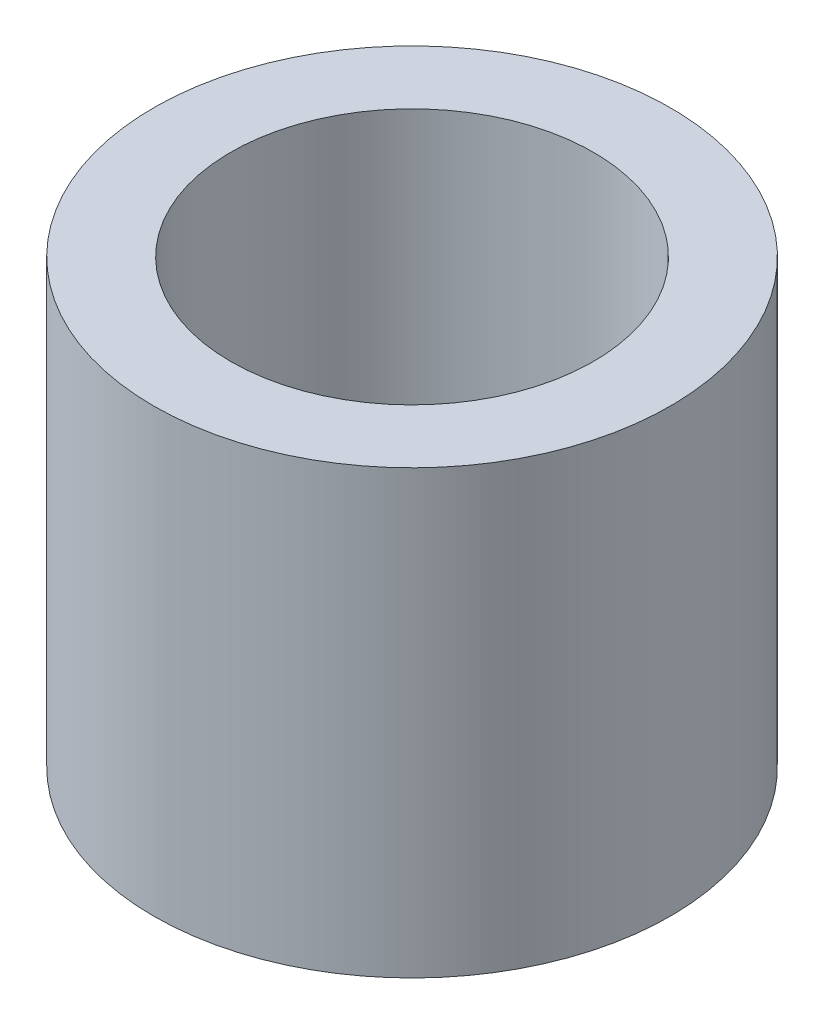
ISO-10303-21;
HEADER;
FILE_DESCRIPTION(('STEP AP214'),'2;1');
FILE_NAME('part.step','',(''),(''),'','','');
FILE_SCHEMA(('AUTOMOTIVE_DESIGN { 1 0 10303 214 1 1 1 1 }'));
ENDSEC;
DATA;
#1=APPLICATION_CONTEXT('core data for automotive mechanical design processes');
#2=APPLICATION_PROTOCOL_DEFINITION('international standard','automotive_design',2000,#1);
#3=PRODUCT_CONTEXT('',#1,'mechanical');
#4=PRODUCT('Part','Part','',(#3));
#5=PRODUCT_RELATED_PRODUCT_CATEGORY('part','',(#4));
#6=PRODUCT_DEFINITION_FORMATION('','',#4);
#7=PRODUCT_DEFINITION_CONTEXT('part definition',#1,'design');
#8=PRODUCT_DEFINITION('design','',#6,#7);
#9=PRODUCT_DEFINITION_SHAPE('','',#8);
#10=(LENGTH_UNIT() NAMED_UNIT(*) SI_UNIT(.MILLI.,.METRE.));
#11=(NAMED_UNIT(*) PLANE_ANGLE_UNIT() SI_UNIT($,.RADIAN.));
#12=(NAMED_UNIT(*) SI_UNIT($,.STERADIAN.) SOLID_ANGLE_UNIT());
#13=UNCERTAINTY_MEASURE_WITH_UNIT(LENGTH_MEASURE(1.E-05),#10,'distance_accuracy_value','');
#14=(GEOMETRIC_REPRESENTATION_CONTEXT(3) GLOBAL_UNCERTAINTY_ASSIGNED_CONTEXT((#13)) GLOBAL_UNIT_ASSIGNED_CONTEXT((#10,
#11,#12)) REPRESENTATION_CONTEXT('',''));
#15=CARTESIAN_POINT('',(0.,0.,0.));
#16=DIRECTION('',(0.,0.,1.));
#17=DIRECTION('',(1.,0.,0.));
#18=AXIS2_PLACEMENT_3D('',#15,#16,#17);
#19=CARTESIAN_POINT('',(0.,38.4786991397978,0.));
#20=DIRECTION('',(0.,-1.,0.));
#21=DIRECTION('',(0.,0.,-1.));
#22=AXIS2_PLACEMENT_3D('',#19,#20,#21);
#23=CYLINDRICAL_SURFACE('',#22,22.5);
#24=CARTESIAN_POINT('',(0.,38.4786991397978,0.));
#25=DIRECTION('',(0.,1.,0.));
#26=DIRECTION('',(0.,0.,1.));
#27=AXIS2_PLACEMENT_3D('',#24,#25,#26);
#28=CIRCLE('',#27,22.5);
#29=CARTESIAN_POINT('',(0.,38.4786991397978,22.5));
#30=VERTEX_POINT('',#29);
#31=EDGE_CURVE('E10',#30,#30,#28,.T.);
#32=ORIENTED_EDGE('',*,*,#31,.F.);
#33=EDGE_LOOP('',(#32));
#34=FACE_BOUND('',#33,.T.);
#35=CARTESIAN_POINT('',(0.,0.,0.));
#36=DIRECTION('',(0.,1.,0.));
#37=DIRECTION('',(0.,0.,1.));
#38=AXIS2_PLACEMENT_3D('',#35,#36,#37);
#39=CIRCLE('',#38,22.5);
#40=CARTESIAN_POINT('',(0.,0.,22.5));
#41=VERTEX_POINT('',#40);
#42=EDGE_CURVE('E37',#41,#41,#39,.T.);
#43=ORIENTED_EDGE('',*,*,#42,.T.);
#44=EDGE_LOOP('',(#43));
#45=FACE_BOUND('',#44,.T.);
#46=ADVANCED_FACE('F40',(#34,#45),#23,.T.);
#47=CARTESIAN_POINT('',(0.,38.4786991397978,0.));
#48=DIRECTION('',(0.,1.,0.));
#49=DIRECTION('',(0.,0.,1.));
#50=AXIS2_PLACEMENT_3D('',#47,#48,#49);
#51=PLANE('',#50);
#52=CARTESIAN_POINT('',(0.,38.4786991397978,0.));
#53=DIRECTION('',(0.,1.,0.));
#54=DIRECTION('',(0.,0.,1.));
#55=AXIS2_PLACEMENT_3D('',#52,#53,#54);
#56=CIRCLE('',#55,15.7914200209467);
#57=CARTESIAN_POINT('',(0.,38.4786991397978,15.7914200209467));
#58=VERTEX_POINT('',#57);
#59=EDGE_CURVE('E50',#58,#58,#56,.T.);
#60=ORIENTED_EDGE('',*,*,#59,.F.);
#61=EDGE_LOOP('',(#60));
#62=FACE_BOUND('',#61,.T.);
#63=ORIENTED_EDGE('',*,*,#31,.T.);
#64=EDGE_LOOP('',(#63));
#65=FACE_BOUND('',#64,.T.);
#66=ADVANCED_FACE('F59',(#62,#65),#51,.T.);
#67=CARTESIAN_POINT('',(0.,0.,0.));
#68=DIRECTION('',(0.,1.,0.));
#69=DIRECTION('',(0.,0.,1.));
#70=AXIS2_PLACEMENT_3D('',#67,#68,#69);
#71=PLANE('',#70);
#72=CARTESIAN_POINT('',(0.,0.,0.));
#73=DIRECTION('',(0.,1.,0.));
#74=DIRECTION('',(0.,0.,1.));
#75=AXIS2_PLACEMENT_3D('',#72,#73,#74);
#76=CIRCLE('',#75,15.7914200209467);
#77=CARTESIAN_POINT('',(0.,0.,15.7914200209467));
#78=VERTEX_POINT('',#77);
#79=EDGE_CURVE('E47',#78,#78,#76,.T.);
#80=ORIENTED_EDGE('',*,*,#79,.T.);
#81=EDGE_LOOP('',(#80));
#82=FACE_BOUND('',#81,.T.);
#83=ORIENTED_EDGE('',*,*,#42,.F.);
#84=EDGE_LOOP('',(#83));
#85=FACE_BOUND('',#84,.T.);
#86=ADVANCED_FACE('F58',(#82,#85),#71,.F.);
#87=CARTESIAN_POINT('',(0.,38.4786991397978,0.));
#88=DIRECTION('',(0.,-1.,0.));
#89=DIRECTION('',(0.,0.,-1.));
#90=AXIS2_PLACEMENT_3D('',#87,#88,#89);
#91=CYLINDRICAL_SURFACE('',#90,15.7914200209467);
#92=ORIENTED_EDGE('',*,*,#59,.T.);
#93=EDGE_LOOP('',(#92));
#94=FACE_BOUND('',#93,.T.);
#95=ORIENTED_EDGE('',*,*,#79,.F.);
#96=EDGE_LOOP('',(#95));
#97=FACE_BOUND('',#96,.T.);
#98=ADVANCED_FACE('F54',(#94,#97),#91,.F.);
#99=CLOSED_SHELL('',(#46,#66,#86,#98));
#100=MANIFOLD_SOLID_BREP('B2',#99);
#101=ADVANCED_BREP_SHAPE_REPRESENTATION('',(#18,#100),#14);
#102=SHAPE_DEFINITION_REPRESENTATION(#9,#101);
ENDSEC;
END-ISO-10303-21;
